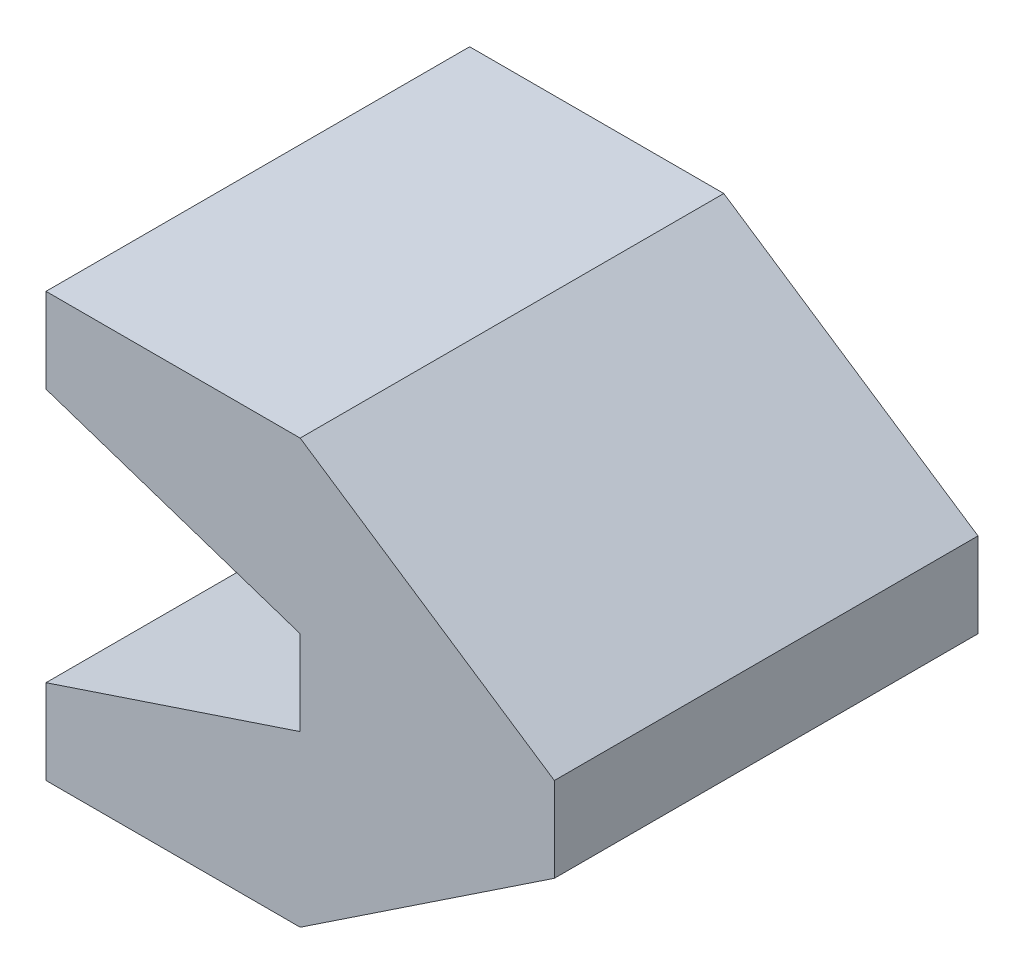
ISO-10303-21;
HEADER;
FILE_DESCRIPTION(('STEP AP214'),'2;1');
FILE_NAME('part.step','',(''),(''),'','','');
FILE_SCHEMA(('AUTOMOTIVE_DESIGN { 1 0 10303 214 1 1 1 1 }'));
ENDSEC;
DATA;
#1=APPLICATION_CONTEXT('core data for automotive mechanical design processes');
#2=APPLICATION_PROTOCOL_DEFINITION('international standard','automotive_design',2000,#1);
#3=PRODUCT_CONTEXT('',#1,'mechanical');
#4=PRODUCT('Part','Part','',(#3));
#5=PRODUCT_RELATED_PRODUCT_CATEGORY('part','',(#4));
#6=PRODUCT_DEFINITION_FORMATION('','',#4);
#7=PRODUCT_DEFINITION_CONTEXT('part definition',#1,'design');
#8=PRODUCT_DEFINITION('design','',#6,#7);
#9=PRODUCT_DEFINITION_SHAPE('','',#8);
#10=(LENGTH_UNIT() NAMED_UNIT(*) SI_UNIT(.MILLI.,.METRE.));
#11=(NAMED_UNIT(*) PLANE_ANGLE_UNIT() SI_UNIT($,.RADIAN.));
#12=(NAMED_UNIT(*) SI_UNIT($,.STERADIAN.) SOLID_ANGLE_UNIT());
#13=UNCERTAINTY_MEASURE_WITH_UNIT(LENGTH_MEASURE(1.E-05),#10,'distance_accuracy_value','');
#14=(GEOMETRIC_REPRESENTATION_CONTEXT(3) GLOBAL_UNCERTAINTY_ASSIGNED_CONTEXT((#13)) GLOBAL_UNIT_ASSIGNED_CONTEXT((#10,
#11,#12)) REPRESENTATION_CONTEXT('',''));
#15=CARTESIAN_POINT('',(0.,0.,0.));
#16=DIRECTION('',(0.,0.,1.));
#17=DIRECTION('',(1.,0.,0.));
#18=AXIS2_PLACEMENT_3D('',#15,#16,#17);
#19=CARTESIAN_POINT('',(-15.,20.,25.));
#20=DIRECTION('',(1.,0.,0.));
#21=DIRECTION('',(0.,1.,0.));
#22=AXIS2_PLACEMENT_3D('',#19,#20,#21);
#23=PLANE('',#22);
#24=DIRECTION('',(0.,-1.,0.));
#25=VECTOR('',#24,1.);
#26=CARTESIAN_POINT('',(-15.,20.,0.));
#27=LINE('',#26,#25);
#28=CARTESIAN_POINT('',(-15.,25.,0.));
#29=VERTEX_POINT('',#28);
#30=CARTESIAN_POINT('',(-15.,20.,0.));
#31=VERTEX_POINT('',#30);
#32=EDGE_CURVE('E141',#29,#31,#27,.T.);
#33=ORIENTED_EDGE('',*,*,#32,.T.);
#34=DIRECTION('',(0.,0.,-1.));
#35=VECTOR('',#34,1.);
#36=CARTESIAN_POINT('',(-15.,20.,25.));
#37=LINE('',#36,#35);
#38=CARTESIAN_POINT('',(-15.,20.,25.));
#39=VERTEX_POINT('',#38);
#40=EDGE_CURVE('E11',#39,#31,#37,.T.);
#41=ORIENTED_EDGE('',*,*,#40,.F.);
#42=DIRECTION('',(0.,-1.,0.));
#43=VECTOR('',#42,1.);
#44=CARTESIAN_POINT('',(-15.,20.,25.));
#45=LINE('',#44,#43);
#46=CARTESIAN_POINT('',(-15.,25.,25.));
#47=VERTEX_POINT('',#46);
#48=EDGE_CURVE('E159',#47,#39,#45,.T.);
#49=ORIENTED_EDGE('',*,*,#48,.F.);
#50=DIRECTION('',(0.,0.,-1.));
#51=VECTOR('',#50,1.);
#52=CARTESIAN_POINT('',(-15.,25.,25.));
#53=LINE('',#52,#51);
#54=EDGE_CURVE('E137',#47,#29,#53,.T.);
#55=ORIENTED_EDGE('',*,*,#54,.T.);
#56=EDGE_LOOP('',(#33,#41,#49,#55));
#57=FACE_BOUND('',#56,.T.);
#58=ADVANCED_FACE('F33',(#57),#23,.F.);
#59=CARTESIAN_POINT('',(0.,15.,25.));
#60=DIRECTION('',(0.316227766016838,0.948683298050514,0.));
#61=DIRECTION('',(-0.948683298050514,0.316227766016838,0.));
#62=AXIS2_PLACEMENT_3D('',#59,#60,#61);
#63=PLANE('',#62);
#64=DIRECTION('',(0.948683298050514,-0.316227766016838,0.));
#65=VECTOR('',#64,1.);
#66=CARTESIAN_POINT('',(0.,15.,0.));
#67=LINE('',#66,#65);
#68=CARTESIAN_POINT('',(0.,15.,0.));
#69=VERTEX_POINT('',#68);
#70=EDGE_CURVE('E144',#31,#69,#67,.T.);
#71=ORIENTED_EDGE('',*,*,#70,.T.);
#72=DIRECTION('',(0.,0.,-1.));
#73=VECTOR('',#72,1.);
#74=CARTESIAN_POINT('',(0.,15.,25.));
#75=LINE('',#74,#73);
#76=CARTESIAN_POINT('',(0.,15.,25.));
#77=VERTEX_POINT('',#76);
#78=EDGE_CURVE('E41',#77,#69,#75,.T.);
#79=ORIENTED_EDGE('',*,*,#78,.F.);
#80=DIRECTION('',(0.948683298050514,-0.316227766016838,0.));
#81=VECTOR('',#80,1.);
#82=CARTESIAN_POINT('',(0.,15.,25.));
#83=LINE('',#82,#81);
#84=EDGE_CURVE('E98',#39,#77,#83,.T.);
#85=ORIENTED_EDGE('',*,*,#84,.F.);
#86=ORIENTED_EDGE('',*,*,#40,.T.);
#87=EDGE_LOOP('',(#71,#79,#85,#86));
#88=FACE_BOUND('',#87,.T.);
#89=ADVANCED_FACE('F208',(#88),#63,.F.);
#90=CARTESIAN_POINT('',(0.,10.,25.));
#91=DIRECTION('',(1.,0.,0.));
#92=DIRECTION('',(0.,0.,-1.));
#93=AXIS2_PLACEMENT_3D('',#90,#91,#92);
#94=PLANE('',#93);
#95=DIRECTION('',(0.,-1.,0.));
#96=VECTOR('',#95,1.);
#97=CARTESIAN_POINT('',(0.,10.,0.));
#98=LINE('',#97,#96);
#99=CARTESIAN_POINT('',(0.,10.,0.));
#100=VERTEX_POINT('',#99);
#101=EDGE_CURVE('E146',#69,#100,#98,.T.);
#102=ORIENTED_EDGE('',*,*,#101,.T.);
#103=DIRECTION('',(0.,0.,-1.));
#104=VECTOR('',#103,1.);
#105=CARTESIAN_POINT('',(0.,10.,25.));
#106=LINE('',#105,#104);
#107=CARTESIAN_POINT('',(0.,10.,25.));
#108=VERTEX_POINT('',#107);
#109=EDGE_CURVE('E172',#108,#100,#106,.T.);
#110=ORIENTED_EDGE('',*,*,#109,.F.);
#111=DIRECTION('',(0.,-1.,0.));
#112=VECTOR('',#111,1.);
#113=CARTESIAN_POINT('',(0.,10.,25.));
#114=LINE('',#113,#112);
#115=EDGE_CURVE('E180',#77,#108,#114,.T.);
#116=ORIENTED_EDGE('',*,*,#115,.F.);
#117=ORIENTED_EDGE('',*,*,#78,.T.);
#118=EDGE_LOOP('',(#102,#110,#116,#117));
#119=FACE_BOUND('',#118,.T.);
#120=ADVANCED_FACE('F178',(#119),#94,.F.);
#121=CARTESIAN_POINT('',(-15.,5.,25.));
#122=DIRECTION('',(0.316227766016838,-0.948683298050514,0.));
#123=DIRECTION('',(0.948683298050514,0.316227766016838,0.));
#124=AXIS2_PLACEMENT_3D('',#121,#122,#123);
#125=PLANE('',#124);
#126=DIRECTION('',(-0.948683298050514,-0.316227766016838,0.));
#127=VECTOR('',#126,1.);
#128=CARTESIAN_POINT('',(-15.,5.,0.));
#129=LINE('',#128,#127);
#130=CARTESIAN_POINT('',(-15.,5.,0.));
#131=VERTEX_POINT('',#130);
#132=EDGE_CURVE('E148',#100,#131,#129,.T.);
#133=ORIENTED_EDGE('',*,*,#132,.T.);
#134=DIRECTION('',(0.,0.,-1.));
#135=VECTOR('',#134,1.);
#136=CARTESIAN_POINT('',(-15.,5.,25.));
#137=LINE('',#136,#135);
#138=CARTESIAN_POINT('',(-15.,5.,25.));
#139=VERTEX_POINT('',#138);
#140=EDGE_CURVE('E169',#139,#131,#137,.T.);
#141=ORIENTED_EDGE('',*,*,#140,.F.);
#142=DIRECTION('',(-0.948683298050514,-0.316227766016838,0.));
#143=VECTOR('',#142,1.);
#144=CARTESIAN_POINT('',(-15.,5.,25.));
#145=LINE('',#144,#143);
#146=EDGE_CURVE('E198',#108,#139,#145,.T.);
#147=ORIENTED_EDGE('',*,*,#146,.F.);
#148=ORIENTED_EDGE('',*,*,#109,.T.);
#149=EDGE_LOOP('',(#133,#141,#147,#148));
#150=FACE_BOUND('',#149,.T.);
#151=ADVANCED_FACE('F189',(#150),#125,.F.);
#152=CARTESIAN_POINT('',(-15.,0.,25.));
#153=DIRECTION('',(1.,0.,0.));
#154=DIRECTION('',(0.,0.,-1.));
#155=AXIS2_PLACEMENT_3D('',#152,#153,#154);
#156=PLANE('',#155);
#157=DIRECTION('',(0.,-1.,0.));
#158=VECTOR('',#157,1.);
#159=CARTESIAN_POINT('',(-15.,0.,0.));
#160=LINE('',#159,#158);
#161=CARTESIAN_POINT('',(-15.,0.,0.));
#162=VERTEX_POINT('',#161);
#163=EDGE_CURVE('E150',#131,#162,#160,.T.);
#164=ORIENTED_EDGE('',*,*,#163,.T.);
#165=DIRECTION('',(0.,0.,-1.));
#166=VECTOR('',#165,1.);
#167=CARTESIAN_POINT('',(-15.,0.,25.));
#168=LINE('',#167,#166);
#169=CARTESIAN_POINT('',(-15.,0.,25.));
#170=VERTEX_POINT('',#169);
#171=EDGE_CURVE('E166',#170,#162,#168,.T.);
#172=ORIENTED_EDGE('',*,*,#171,.F.);
#173=DIRECTION('',(0.,-1.,0.));
#174=VECTOR('',#173,1.);
#175=CARTESIAN_POINT('',(-15.,0.,25.));
#176=LINE('',#175,#174);
#177=EDGE_CURVE('E195',#139,#170,#176,.T.);
#178=ORIENTED_EDGE('',*,*,#177,.F.);
#179=ORIENTED_EDGE('',*,*,#140,.T.);
#180=EDGE_LOOP('',(#164,#172,#178,#179));
#181=FACE_BOUND('',#180,.T.);
#182=ADVANCED_FACE('F193',(#181),#156,.F.);
#183=CARTESIAN_POINT('',(0.,0.,25.));
#184=DIRECTION('',(0.,1.,0.));
#185=DIRECTION('',(0.,0.,1.));
#186=AXIS2_PLACEMENT_3D('',#183,#184,#185);
#187=PLANE('',#186);
#188=DIRECTION('',(1.,0.,0.));
#189=VECTOR('',#188,1.);
#190=CARTESIAN_POINT('',(0.,0.,0.));
#191=LINE('',#190,#189);
#192=CARTESIAN_POINT('',(0.,0.,0.));
#193=VERTEX_POINT('',#192);
#194=EDGE_CURVE('E152',#162,#193,#191,.T.);
#195=ORIENTED_EDGE('',*,*,#194,.T.);
#196=DIRECTION('',(0.,0.,-1.));
#197=VECTOR('',#196,1.);
#198=CARTESIAN_POINT('',(0.,0.,25.));
#199=LINE('',#198,#197);
#200=CARTESIAN_POINT('',(0.,0.,25.));
#201=VERTEX_POINT('',#200);
#202=EDGE_CURVE('E163',#201,#193,#199,.T.);
#203=ORIENTED_EDGE('',*,*,#202,.F.);
#204=DIRECTION('',(1.,0.,0.));
#205=VECTOR('',#204,1.);
#206=CARTESIAN_POINT('',(0.,0.,25.));
#207=LINE('',#206,#205);
#208=EDGE_CURVE('E197',#170,#201,#207,.T.);
#209=ORIENTED_EDGE('',*,*,#208,.F.);
#210=ORIENTED_EDGE('',*,*,#171,.T.);
#211=EDGE_LOOP('',(#195,#203,#209,#210));
#212=FACE_BOUND('',#211,.T.);
#213=ADVANCED_FACE('F220',(#212),#187,.F.);
#214=CARTESIAN_POINT('',(15.,10.,25.));
#215=DIRECTION('',(-0.554700196225229,0.832050294337843,0.));
#216=DIRECTION('',(-0.832050294337844,-0.554700196225229,0.));
#217=AXIS2_PLACEMENT_3D('',#214,#215,#216);
#218=PLANE('',#217);
#219=DIRECTION('',(0.832050294337844,0.554700196225229,0.));
#220=VECTOR('',#219,1.);
#221=CARTESIAN_POINT('',(15.,10.,0.));
#222=LINE('',#221,#220);
#223=CARTESIAN_POINT('',(15.,10.,0.));
#224=VERTEX_POINT('',#223);
#225=EDGE_CURVE('E154',#193,#224,#222,.T.);
#226=ORIENTED_EDGE('',*,*,#225,.T.);
#227=DIRECTION('',(0.,0.,-1.));
#228=VECTOR('',#227,1.);
#229=CARTESIAN_POINT('',(15.,10.,25.));
#230=LINE('',#229,#228);
#231=CARTESIAN_POINT('',(15.,10.,25.));
#232=VERTEX_POINT('',#231);
#233=EDGE_CURVE('E132',#232,#224,#230,.T.);
#234=ORIENTED_EDGE('',*,*,#233,.F.);
#235=DIRECTION('',(0.832050294337844,0.554700196225229,0.));
#236=VECTOR('',#235,1.);
#237=CARTESIAN_POINT('',(15.,10.,25.));
#238=LINE('',#237,#236);
#239=EDGE_CURVE('E123',#201,#232,#238,.T.);
#240=ORIENTED_EDGE('',*,*,#239,.F.);
#241=ORIENTED_EDGE('',*,*,#202,.T.);
#242=EDGE_LOOP('',(#226,#234,#240,#241));
#243=FACE_BOUND('',#242,.T.);
#244=ADVANCED_FACE('F223',(#243),#218,.F.);
#245=CARTESIAN_POINT('',(15.,15.,25.));
#246=DIRECTION('',(-1.,0.,0.));
#247=DIRECTION('',(0.,0.,1.));
#248=AXIS2_PLACEMENT_3D('',#245,#246,#247);
#249=PLANE('',#248);
#250=DIRECTION('',(0.,1.,0.));
#251=VECTOR('',#250,1.);
#252=CARTESIAN_POINT('',(15.,15.,0.));
#253=LINE('',#252,#251);
#254=CARTESIAN_POINT('',(15.,15.,0.));
#255=VERTEX_POINT('',#254);
#256=EDGE_CURVE('E131',#224,#255,#253,.T.);
#257=ORIENTED_EDGE('',*,*,#256,.T.);
#258=DIRECTION('',(0.,0.,-1.));
#259=VECTOR('',#258,1.);
#260=CARTESIAN_POINT('',(15.,15.,25.));
#261=LINE('',#260,#259);
#262=CARTESIAN_POINT('',(15.,15.,25.));
#263=VERTEX_POINT('',#262);
#264=EDGE_CURVE('E128',#263,#255,#261,.T.);
#265=ORIENTED_EDGE('',*,*,#264,.F.);
#266=DIRECTION('',(0.,1.,0.));
#267=VECTOR('',#266,1.);
#268=CARTESIAN_POINT('',(15.,15.,25.));
#269=LINE('',#268,#267);
#270=EDGE_CURVE('E117',#232,#263,#269,.T.);
#271=ORIENTED_EDGE('',*,*,#270,.F.);
#272=ORIENTED_EDGE('',*,*,#233,.T.);
#273=EDGE_LOOP('',(#257,#265,#271,#272));
#274=FACE_BOUND('',#273,.T.);
#275=ADVANCED_FACE('F129',(#274),#249,.F.);
#276=CARTESIAN_POINT('',(0.,25.,25.));
#277=DIRECTION('',(-0.554700196225229,-0.832050294337844,0.));
#278=DIRECTION('',(0.832050294337844,-0.554700196225229,0.));
#279=AXIS2_PLACEMENT_3D('',#276,#277,#278);
#280=PLANE('',#279);
#281=DIRECTION('',(-0.832050294337843,0.554700196225229,0.));
#282=VECTOR('',#281,1.);
#283=CARTESIAN_POINT('',(0.,25.,0.));
#284=LINE('',#283,#282);
#285=CARTESIAN_POINT('',(0.,25.,0.));
#286=VERTEX_POINT('',#285);
#287=EDGE_CURVE('E84',#255,#286,#284,.T.);
#288=ORIENTED_EDGE('',*,*,#287,.T.);
#289=DIRECTION('',(0.,0.,-1.));
#290=VECTOR('',#289,1.);
#291=CARTESIAN_POINT('',(0.,25.,25.));
#292=LINE('',#291,#290);
#293=CARTESIAN_POINT('',(0.,25.,25.));
#294=VERTEX_POINT('',#293);
#295=EDGE_CURVE('E133',#294,#286,#292,.T.);
#296=ORIENTED_EDGE('',*,*,#295,.F.);
#297=DIRECTION('',(-0.832050294337843,0.554700196225229,0.));
#298=VECTOR('',#297,1.);
#299=CARTESIAN_POINT('',(0.,25.,25.));
#300=LINE('',#299,#298);
#301=EDGE_CURVE('E121',#263,#294,#300,.T.);
#302=ORIENTED_EDGE('',*,*,#301,.F.);
#303=ORIENTED_EDGE('',*,*,#264,.T.);
#304=EDGE_LOOP('',(#288,#296,#302,#303));
#305=FACE_BOUND('',#304,.T.);
#306=ADVANCED_FACE('F135',(#305),#280,.F.);
#307=CARTESIAN_POINT('',(-15.,25.,25.));
#308=DIRECTION('',(0.,-1.,0.));
#309=DIRECTION('',(0.,0.,-1.));
#310=AXIS2_PLACEMENT_3D('',#307,#308,#309);
#311=PLANE('',#310);
#312=DIRECTION('',(-1.,0.,0.));
#313=VECTOR('',#312,1.);
#314=CARTESIAN_POINT('',(-15.,25.,0.));
#315=LINE('',#314,#313);
#316=EDGE_CURVE('E90',#286,#29,#315,.T.);
#317=ORIENTED_EDGE('',*,*,#316,.T.);
#318=ORIENTED_EDGE('',*,*,#54,.F.);
#319=DIRECTION('',(-1.,0.,0.));
#320=VECTOR('',#319,1.);
#321=CARTESIAN_POINT('',(-15.,25.,25.));
#322=LINE('',#321,#320);
#323=EDGE_CURVE('E49',#294,#47,#322,.T.);
#324=ORIENTED_EDGE('',*,*,#323,.F.);
#325=ORIENTED_EDGE('',*,*,#295,.T.);
#326=EDGE_LOOP('',(#317,#318,#324,#325));
#327=FACE_BOUND('',#326,.T.);
#328=ADVANCED_FACE('F232',(#327),#311,.F.);
#329=CARTESIAN_POINT('',(0.,0.,25.));
#330=DIRECTION('',(0.,0.,-1.));
#331=DIRECTION('',(-1.,0.,0.));
#332=AXIS2_PLACEMENT_3D('',#329,#330,#331);
#333=PLANE('',#332);
#334=ORIENTED_EDGE('',*,*,#48,.T.);
#335=ORIENTED_EDGE('',*,*,#84,.T.);
#336=ORIENTED_EDGE('',*,*,#115,.T.);
#337=ORIENTED_EDGE('',*,*,#146,.T.);
#338=ORIENTED_EDGE('',*,*,#177,.T.);
#339=ORIENTED_EDGE('',*,*,#208,.T.);
#340=ORIENTED_EDGE('',*,*,#239,.T.);
#341=ORIENTED_EDGE('',*,*,#270,.T.);
#342=ORIENTED_EDGE('',*,*,#301,.T.);
#343=ORIENTED_EDGE('',*,*,#323,.T.);
#344=EDGE_LOOP('',(#334,#335,#336,#337,#338,#339,#340,#341,#342,#343));
#345=FACE_BOUND('',#344,.T.);
#346=ADVANCED_FACE('F119',(#345),#333,.F.);
#347=CARTESIAN_POINT('',(0.,0.,0.));
#348=DIRECTION('',(0.,0.,-1.));
#349=DIRECTION('',(-1.,0.,0.));
#350=AXIS2_PLACEMENT_3D('',#347,#348,#349);
#351=PLANE('',#350);
#352=ORIENTED_EDGE('',*,*,#32,.F.);
#353=ORIENTED_EDGE('',*,*,#316,.F.);
#354=ORIENTED_EDGE('',*,*,#287,.F.);
#355=ORIENTED_EDGE('',*,*,#256,.F.);
#356=ORIENTED_EDGE('',*,*,#225,.F.);
#357=ORIENTED_EDGE('',*,*,#194,.F.);
#358=ORIENTED_EDGE('',*,*,#163,.F.);
#359=ORIENTED_EDGE('',*,*,#132,.F.);
#360=ORIENTED_EDGE('',*,*,#101,.F.);
#361=ORIENTED_EDGE('',*,*,#70,.F.);
#362=EDGE_LOOP('',(#352,#353,#354,#355,#356,#357,#358,#359,#360,#361));
#363=FACE_BOUND('',#362,.T.);
#364=ADVANCED_FACE('F184',(#363),#351,.T.);
#365=CLOSED_SHELL('',(#58,#89,#120,#151,#182,#213,#244,#275,#306,#328,#346,#364));
#366=MANIFOLD_SOLID_BREP('B2',#365);
#367=ADVANCED_BREP_SHAPE_REPRESENTATION('',(#18,#366),#14);
#368=SHAPE_DEFINITION_REPRESENTATION(#9,#367);
ENDSEC;
END-ISO-10303-21;
